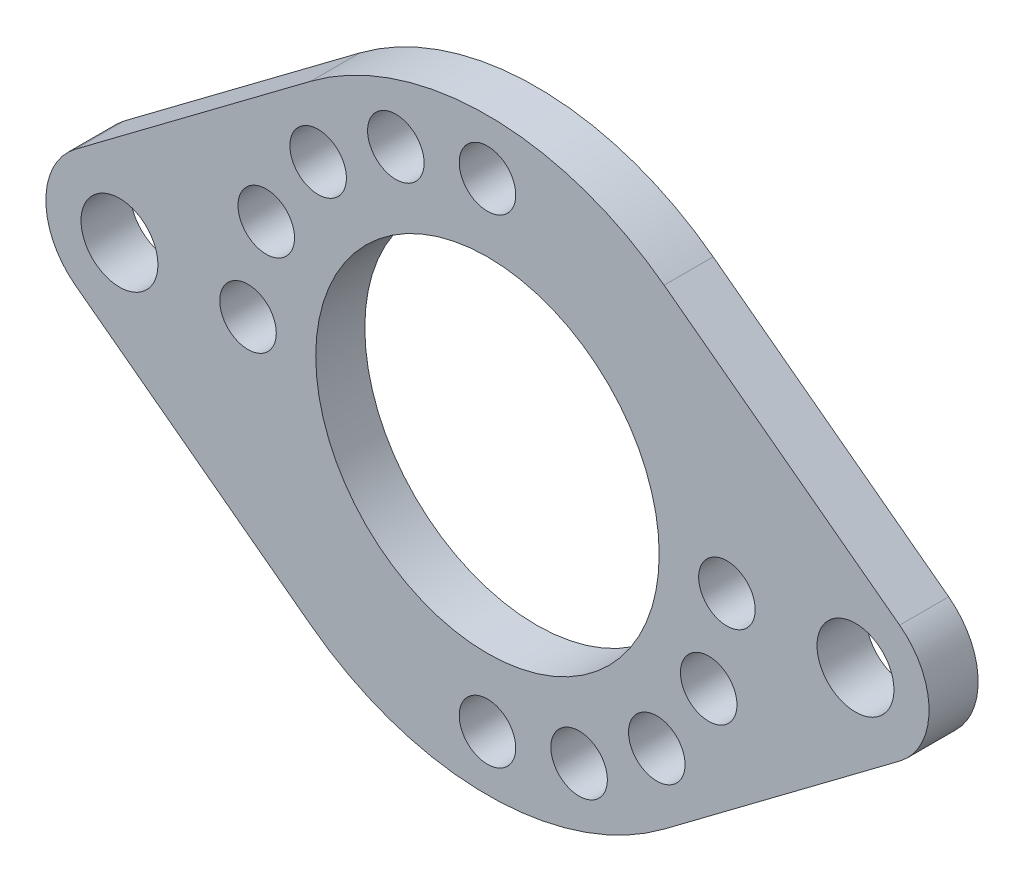
ISO-10303-21;
HEADER;
FILE_DESCRIPTION(('STEP AP214'),'2;1');
FILE_NAME('part.step','',(''),(''),'','','');
FILE_SCHEMA(('AUTOMOTIVE_DESIGN { 1 0 10303 214 1 1 1 1 }'));
ENDSEC;
DATA;
#1=APPLICATION_CONTEXT('core data for automotive mechanical design processes');
#2=APPLICATION_PROTOCOL_DEFINITION('international standard','automotive_design',2000,#1);
#3=PRODUCT_CONTEXT('',#1,'mechanical');
#4=PRODUCT('Part','Part','',(#3));
#5=PRODUCT_RELATED_PRODUCT_CATEGORY('part','',(#4));
#6=PRODUCT_DEFINITION_FORMATION('','',#4);
#7=PRODUCT_DEFINITION_CONTEXT('part definition',#1,'design');
#8=PRODUCT_DEFINITION('design','',#6,#7);
#9=PRODUCT_DEFINITION_SHAPE('','',#8);
#10=(LENGTH_UNIT() NAMED_UNIT(*) SI_UNIT(.MILLI.,.METRE.));
#11=(NAMED_UNIT(*) PLANE_ANGLE_UNIT() SI_UNIT($,.RADIAN.));
#12=(NAMED_UNIT(*) SI_UNIT($,.STERADIAN.) SOLID_ANGLE_UNIT());
#13=UNCERTAINTY_MEASURE_WITH_UNIT(LENGTH_MEASURE(1.E-05),#10,'distance_accuracy_value','');
#14=(GEOMETRIC_REPRESENTATION_CONTEXT(3) GLOBAL_UNCERTAINTY_ASSIGNED_CONTEXT((#13)) GLOBAL_UNIT_ASSIGNED_CONTEXT((#10,
#11,#12)) REPRESENTATION_CONTEXT('',''));
#15=CARTESIAN_POINT('',(0.,0.,0.));
#16=DIRECTION('',(0.,0.,1.));
#17=DIRECTION('',(1.,0.,0.));
#18=AXIS2_PLACEMENT_3D('',#15,#16,#17);
#19=CARTESIAN_POINT('',(0.,0.,-1.5875));
#20=DIRECTION('',(0.,0.,1.));
#21=DIRECTION('',(1.,0.,0.));
#22=AXIS2_PLACEMENT_3D('',#19,#20,#21);
#23=PLANE('',#22);
#24=CARTESIAN_POINT('',(0.,0.,-1.5875));
#25=DIRECTION('',(0.,0.,-1.));
#26=DIRECTION('',(-1.,0.,0.));
#27=AXIS2_PLACEMENT_3D('',#24,#25,#26);
#28=CIRCLE('',#27,11.1125);
#29=CARTESIAN_POINT('',(-11.1125,0.,-1.5875));
#30=VERTEX_POINT('',#29);
#31=EDGE_CURVE('E167',#30,#30,#28,.F.);
#32=ORIENTED_EDGE('',*,*,#31,.T.);
#33=EDGE_LOOP('',(#32));
#34=FACE_BOUND('',#33,.T.);
#35=CARTESIAN_POINT('',(-23.8125,0.,-1.5875));
#36=DIRECTION('',(0.,0.,-1.));
#37=DIRECTION('',(-1.,0.,0.));
#38=AXIS2_PLACEMENT_3D('',#35,#36,#37);
#39=CIRCLE('',#38,4.7625);
#40=CARTESIAN_POINT('',(-26.67,3.81,-1.5875));
#41=VERTEX_POINT('',#40);
#42=CARTESIAN_POINT('',(-26.67,-3.81,-1.5875));
#43=VERTEX_POINT('',#42);
#44=EDGE_CURVE('E171',#41,#43,#39,.F.);
#45=ORIENTED_EDGE('',*,*,#44,.F.);
#46=DIRECTION('',(-0.8,-0.6,0.));
#47=VECTOR('',#46,1.);
#48=CARTESIAN_POINT('',(-11.43,15.24,-1.5875));
#49=LINE('',#48,#47);
#50=CARTESIAN_POINT('',(-11.43,15.24,-1.5875));
#51=VERTEX_POINT('',#50);
#52=EDGE_CURVE('E110',#51,#41,#49,.T.);
#53=ORIENTED_EDGE('',*,*,#52,.F.);
#54=CARTESIAN_POINT('',(0.,0.,-1.5875));
#55=DIRECTION('',(0.,0.,-1.));
#56=DIRECTION('',(-1.,0.,0.));
#57=AXIS2_PLACEMENT_3D('',#54,#55,#56);
#58=CIRCLE('',#57,19.05);
#59=CARTESIAN_POINT('',(11.43,15.24,-1.5875));
#60=VERTEX_POINT('',#59);
#61=EDGE_CURVE('E115',#60,#51,#58,.F.);
#62=ORIENTED_EDGE('',*,*,#61,.F.);
#63=DIRECTION('',(0.8,-0.6,0.));
#64=VECTOR('',#63,1.);
#65=CARTESIAN_POINT('',(11.43,15.24,-1.5875));
#66=LINE('',#65,#64);
#67=CARTESIAN_POINT('',(26.67,3.81,-1.5875));
#68=VERTEX_POINT('',#67);
#69=EDGE_CURVE('E114',#60,#68,#66,.T.);
#70=ORIENTED_EDGE('',*,*,#69,.T.);
#71=CARTESIAN_POINT('',(23.8125,0.,-1.5875));
#72=DIRECTION('',(0.,0.,-1.));
#73=DIRECTION('',(-1.,0.,0.));
#74=AXIS2_PLACEMENT_3D('',#71,#72,#73);
#75=CIRCLE('',#74,4.7625);
#76=CARTESIAN_POINT('',(26.67,-3.81,-1.5875));
#77=VERTEX_POINT('',#76);
#78=EDGE_CURVE('E94',#77,#68,#75,.F.);
#79=ORIENTED_EDGE('',*,*,#78,.F.);
#80=DIRECTION('',(-0.8,-0.6,0.));
#81=VECTOR('',#80,1.);
#82=CARTESIAN_POINT('',(11.43,-15.24,-1.5875));
#83=LINE('',#82,#81);
#84=CARTESIAN_POINT('',(11.43,-15.24,-1.5875));
#85=VERTEX_POINT('',#84);
#86=EDGE_CURVE('E91',#77,#85,#83,.T.);
#87=ORIENTED_EDGE('',*,*,#86,.T.);
#88=CARTESIAN_POINT('',(0.,0.,-1.5875));
#89=DIRECTION('',(0.,0.,-1.));
#90=DIRECTION('',(-1.,0.,0.));
#91=AXIS2_PLACEMENT_3D('',#88,#89,#90);
#92=CIRCLE('',#91,19.05);
#93=CARTESIAN_POINT('',(-11.43,-15.24,-1.5875));
#94=VERTEX_POINT('',#93);
#95=EDGE_CURVE('E78',#94,#85,#92,.F.);
#96=ORIENTED_EDGE('',*,*,#95,.F.);
#97=DIRECTION('',(-0.8,0.6,0.));
#98=VECTOR('',#97,1.);
#99=CARTESIAN_POINT('',(-11.43,-15.24,-1.5875));
#100=LINE('',#99,#98);
#101=EDGE_CURVE('E88',#94,#43,#100,.T.);
#102=ORIENTED_EDGE('',*,*,#101,.T.);
#103=EDGE_LOOP('',(#45,#53,#62,#70,#79,#87,#96,#102));
#104=FACE_BOUND('',#103,.T.);
#105=CARTESIAN_POINT('',(0.,15.494,-1.5875));
#106=DIRECTION('',(0.,0.,1.));
#107=DIRECTION('',(1.,0.,0.));
#108=AXIS2_PLACEMENT_3D('',#105,#106,#107);
#109=CIRCLE('',#108,1.82879999999999);
#110=CARTESIAN_POINT('',(1.82879999999999,15.494,-1.5875));
#111=VERTEX_POINT('',#110);
#112=EDGE_CURVE('E109',#111,#111,#109,.T.);
#113=ORIENTED_EDGE('',*,*,#112,.T.);
#114=EDGE_LOOP('',(#113));
#115=FACE_BOUND('',#114,.T.);
#116=CARTESIAN_POINT('',(-15.494,0.,-1.5875));
#117=DIRECTION('',(0.,0.,1.));
#118=DIRECTION('',(1.,0.,0.));
#119=AXIS2_PLACEMENT_3D('',#116,#117,#118);
#120=CIRCLE('',#119,1.82879999999999);
#121=CARTESIAN_POINT('',(-13.6652,0.,-1.5875));
#122=VERTEX_POINT('',#121);
#123=EDGE_CURVE('E179',#122,#122,#120,.T.);
#124=ORIENTED_EDGE('',*,*,#123,.T.);
#125=EDGE_LOOP('',(#124));
#126=FACE_BOUND('',#125,.T.);
#127=CARTESIAN_POINT('',(-14.3145894767299,5.92929710106476,-1.5875));
#128=DIRECTION('',(0.,0.,1.));
#129=DIRECTION('',(1.,0.,0.));
#130=AXIS2_PLACEMENT_3D('',#127,#128,#129);
#131=CIRCLE('',#130,1.82879999999999);
#132=CARTESIAN_POINT('',(-12.4857894767299,5.92929710106476,-1.5875));
#133=VERTEX_POINT('',#132);
#134=EDGE_CURVE('E182',#133,#133,#131,.T.);
#135=ORIENTED_EDGE('',*,*,#134,.T.);
#136=EDGE_LOOP('',(#135));
#137=FACE_BOUND('',#136,.T.);
#138=CARTESIAN_POINT('',(-5.92929710106471,14.3145894767299,-1.5875));
#139=DIRECTION('',(0.,0.,1.));
#140=DIRECTION('',(1.,0.,0.));
#141=AXIS2_PLACEMENT_3D('',#138,#139,#140);
#142=CIRCLE('',#141,1.82879999999999);
#143=CARTESIAN_POINT('',(-4.10049710106472,14.3145894767299,-1.5875));
#144=VERTEX_POINT('',#143);
#145=EDGE_CURVE('E185',#144,#144,#142,.T.);
#146=ORIENTED_EDGE('',*,*,#145,.T.);
#147=EDGE_LOOP('',(#146));
#148=FACE_BOUND('',#147,.T.);
#149=CARTESIAN_POINT('',(-10.9559124677044,10.9559124677043,-1.5875));
#150=DIRECTION('',(0.,0.,1.));
#151=DIRECTION('',(1.,0.,0.));
#152=AXIS2_PLACEMENT_3D('',#149,#150,#151);
#153=CIRCLE('',#152,1.82879999999999);
#154=CARTESIAN_POINT('',(-9.1271124677044,10.9559124677043,-1.5875));
#155=VERTEX_POINT('',#154);
#156=EDGE_CURVE('E188',#155,#155,#153,.T.);
#157=ORIENTED_EDGE('',*,*,#156,.T.);
#158=EDGE_LOOP('',(#157));
#159=FACE_BOUND('',#158,.T.);
#160=CARTESIAN_POINT('',(0.,-15.494,-1.5875));
#161=DIRECTION('',(0.,0.,1.));
#162=DIRECTION('',(1.,0.,0.));
#163=AXIS2_PLACEMENT_3D('',#160,#161,#162);
#164=CIRCLE('',#163,1.82879999999999);
#165=CARTESIAN_POINT('',(1.82879999999999,-15.494,-1.5875));
#166=VERTEX_POINT('',#165);
#167=EDGE_CURVE('E191',#166,#166,#164,.T.);
#168=ORIENTED_EDGE('',*,*,#167,.T.);
#169=EDGE_LOOP('',(#168));
#170=FACE_BOUND('',#169,.T.);
#171=CARTESIAN_POINT('',(15.494,0.,-1.5875));
#172=DIRECTION('',(0.,0.,1.));
#173=DIRECTION('',(1.,0.,0.));
#174=AXIS2_PLACEMENT_3D('',#171,#172,#173);
#175=CIRCLE('',#174,1.82879999999999);
#176=CARTESIAN_POINT('',(17.3228,0.,-1.5875));
#177=VERTEX_POINT('',#176);
#178=EDGE_CURVE('E194',#177,#177,#175,.T.);
#179=ORIENTED_EDGE('',*,*,#178,.T.);
#180=EDGE_LOOP('',(#179));
#181=FACE_BOUND('',#180,.T.);
#182=CARTESIAN_POINT('',(14.3145894767299,-5.92929710106476,-1.5875));
#183=DIRECTION('',(0.,0.,1.));
#184=DIRECTION('',(1.,0.,0.));
#185=AXIS2_PLACEMENT_3D('',#182,#183,#184);
#186=CIRCLE('',#185,1.82879999999999);
#187=CARTESIAN_POINT('',(16.1433894767298,-5.92929710106476,-1.5875));
#188=VERTEX_POINT('',#187);
#189=EDGE_CURVE('E197',#188,#188,#186,.T.);
#190=ORIENTED_EDGE('',*,*,#189,.T.);
#191=EDGE_LOOP('',(#190));
#192=FACE_BOUND('',#191,.T.);
#193=CARTESIAN_POINT('',(5.92929710106471,-14.3145894767299,-1.5875));
#194=DIRECTION('',(0.,0.,1.));
#195=DIRECTION('',(1.,0.,0.));
#196=AXIS2_PLACEMENT_3D('',#193,#194,#195);
#197=CIRCLE('',#196,1.82879999999999);
#198=CARTESIAN_POINT('',(7.7580971010647,-14.3145894767299,-1.5875));
#199=VERTEX_POINT('',#198);
#200=EDGE_CURVE('E200',#199,#199,#197,.T.);
#201=ORIENTED_EDGE('',*,*,#200,.T.);
#202=EDGE_LOOP('',(#201));
#203=FACE_BOUND('',#202,.T.);
#204=CARTESIAN_POINT('',(10.9559124677044,-10.9559124677043,-1.5875));
#205=DIRECTION('',(0.,0.,1.));
#206=DIRECTION('',(1.,0.,0.));
#207=AXIS2_PLACEMENT_3D('',#204,#205,#206);
#208=CIRCLE('',#207,1.82879999999999);
#209=CARTESIAN_POINT('',(12.7847124677044,-10.9559124677043,-1.5875));
#210=VERTEX_POINT('',#209);
#211=EDGE_CURVE('E203',#210,#210,#208,.T.);
#212=ORIENTED_EDGE('',*,*,#211,.T.);
#213=EDGE_LOOP('',(#212));
#214=FACE_BOUND('',#213,.T.);
#215=CARTESIAN_POINT('',(-23.8125,0.,-1.5875));
#216=DIRECTION('',(0.,0.,1.));
#217=DIRECTION('',(1.,0.,0.));
#218=AXIS2_PLACEMENT_3D('',#215,#216,#217);
#219=CIRCLE('',#218,2.48919999999999);
#220=CARTESIAN_POINT('',(-21.3233,0.,-1.5875));
#221=VERTEX_POINT('',#220);
#222=EDGE_CURVE('E205',#221,#221,#219,.T.);
#223=ORIENTED_EDGE('',*,*,#222,.T.);
#224=EDGE_LOOP('',(#223));
#225=FACE_BOUND('',#224,.T.);
#226=CARTESIAN_POINT('',(23.8125,0.,-1.5875));
#227=DIRECTION('',(0.,0.,1.));
#228=DIRECTION('',(1.,0.,0.));
#229=AXIS2_PLACEMENT_3D('',#226,#227,#228);
#230=CIRCLE('',#229,2.48919999999999);
#231=CARTESIAN_POINT('',(26.3017,0.,-1.5875));
#232=VERTEX_POINT('',#231);
#233=EDGE_CURVE('E19',#232,#232,#230,.T.);
#234=ORIENTED_EDGE('',*,*,#233,.T.);
#235=EDGE_LOOP('',(#234));
#236=FACE_BOUND('',#235,.T.);
#237=ADVANCED_FACE('F16',(#34,#104,#115,#126,#137,#148,#159,#170,#181,#192,#203,#214,#225,#236),
#23,.F.);
#238=CARTESIAN_POINT('',(23.8125,0.,1.5875));
#239=DIRECTION('',(0.,0.,1.));
#240=DIRECTION('',(1.,0.,0.));
#241=AXIS2_PLACEMENT_3D('',#238,#239,#240);
#242=CYLINDRICAL_SURFACE('',#241,2.48919999999999);
#243=CARTESIAN_POINT('',(23.8125,0.,1.5875));
#244=DIRECTION('',(0.,0.,1.));
#245=DIRECTION('',(1.,0.,0.));
#246=AXIS2_PLACEMENT_3D('',#243,#244,#245);
#247=CIRCLE('',#246,2.48919999999999);
#248=CARTESIAN_POINT('',(26.3017,0.,1.5875));
#249=VERTEX_POINT('',#248);
#250=EDGE_CURVE('E164',#249,#249,#247,.F.);
#251=ORIENTED_EDGE('',*,*,#250,.F.);
#252=EDGE_LOOP('',(#251));
#253=FACE_BOUND('',#252,.T.);
#254=ORIENTED_EDGE('',*,*,#233,.F.);
#255=EDGE_LOOP('',(#254));
#256=FACE_BOUND('',#255,.T.);
#257=ADVANCED_FACE('F213',(#253,#256),#242,.F.);
#258=CARTESIAN_POINT('',(-23.8125,0.,1.5875));
#259=DIRECTION('',(0.,0.,1.));
#260=DIRECTION('',(1.,0.,0.));
#261=AXIS2_PLACEMENT_3D('',#258,#259,#260);
#262=CYLINDRICAL_SURFACE('',#261,2.48919999999999);
#263=CARTESIAN_POINT('',(-23.8125,0.,1.5875));
#264=DIRECTION('',(0.,0.,1.));
#265=DIRECTION('',(1.,0.,0.));
#266=AXIS2_PLACEMENT_3D('',#263,#264,#265);
#267=CIRCLE('',#266,2.48919999999999);
#268=CARTESIAN_POINT('',(-21.3233,0.,1.5875));
#269=VERTEX_POINT('',#268);
#270=EDGE_CURVE('E161',#269,#269,#267,.F.);
#271=ORIENTED_EDGE('',*,*,#270,.F.);
#272=EDGE_LOOP('',(#271));
#273=FACE_BOUND('',#272,.T.);
#274=ORIENTED_EDGE('',*,*,#222,.F.);
#275=EDGE_LOOP('',(#274));
#276=FACE_BOUND('',#275,.T.);
#277=ADVANCED_FACE('F215',(#273,#276),#262,.F.);
#278=CARTESIAN_POINT('',(10.9559124677044,-10.9559124677043,1.5875));
#279=DIRECTION('',(0.,0.,1.));
#280=DIRECTION('',(1.,0.,0.));
#281=AXIS2_PLACEMENT_3D('',#278,#279,#280);
#282=CYLINDRICAL_SURFACE('',#281,1.82879999999999);
#283=CARTESIAN_POINT('',(10.9559124677044,-10.9559124677043,1.5875));
#284=DIRECTION('',(0.,0.,1.));
#285=DIRECTION('',(1.,0.,0.));
#286=AXIS2_PLACEMENT_3D('',#283,#284,#285);
#287=CIRCLE('',#286,1.82879999999999);
#288=CARTESIAN_POINT('',(12.7847124677044,-10.9559124677043,1.5875));
#289=VERTEX_POINT('',#288);
#290=EDGE_CURVE('E158',#289,#289,#287,.F.);
#291=ORIENTED_EDGE('',*,*,#290,.F.);
#292=EDGE_LOOP('',(#291));
#293=FACE_BOUND('',#292,.T.);
#294=ORIENTED_EDGE('',*,*,#211,.F.);
#295=EDGE_LOOP('',(#294));
#296=FACE_BOUND('',#295,.T.);
#297=ADVANCED_FACE('F222',(#293,#296),#282,.F.);
#298=CARTESIAN_POINT('',(5.92929710106471,-14.3145894767299,1.5875));
#299=DIRECTION('',(0.,0.,1.));
#300=DIRECTION('',(1.,0.,0.));
#301=AXIS2_PLACEMENT_3D('',#298,#299,#300);
#302=CYLINDRICAL_SURFACE('',#301,1.82879999999999);
#303=CARTESIAN_POINT('',(5.92929710106471,-14.3145894767299,1.5875));
#304=DIRECTION('',(0.,0.,1.));
#305=DIRECTION('',(1.,0.,0.));
#306=AXIS2_PLACEMENT_3D('',#303,#304,#305);
#307=CIRCLE('',#306,1.82879999999999);
#308=CARTESIAN_POINT('',(7.7580971010647,-14.3145894767299,1.5875));
#309=VERTEX_POINT('',#308);
#310=EDGE_CURVE('E155',#309,#309,#307,.F.);
#311=ORIENTED_EDGE('',*,*,#310,.F.);
#312=EDGE_LOOP('',(#311));
#313=FACE_BOUND('',#312,.T.);
#314=ORIENTED_EDGE('',*,*,#200,.F.);
#315=EDGE_LOOP('',(#314));
#316=FACE_BOUND('',#315,.T.);
#317=ADVANCED_FACE('F298',(#313,#316),#302,.F.);
#318=CARTESIAN_POINT('',(14.3145894767299,-5.92929710106476,1.5875));
#319=DIRECTION('',(0.,0.,1.));
#320=DIRECTION('',(1.,0.,0.));
#321=AXIS2_PLACEMENT_3D('',#318,#319,#320);
#322=CYLINDRICAL_SURFACE('',#321,1.82879999999999);
#323=CARTESIAN_POINT('',(14.3145894767299,-5.92929710106476,1.5875));
#324=DIRECTION('',(0.,0.,1.));
#325=DIRECTION('',(1.,0.,0.));
#326=AXIS2_PLACEMENT_3D('',#323,#324,#325);
#327=CIRCLE('',#326,1.82879999999999);
#328=CARTESIAN_POINT('',(16.1433894767298,-5.92929710106476,1.5875));
#329=VERTEX_POINT('',#328);
#330=EDGE_CURVE('E152',#329,#329,#327,.F.);
#331=ORIENTED_EDGE('',*,*,#330,.F.);
#332=EDGE_LOOP('',(#331));
#333=FACE_BOUND('',#332,.T.);
#334=ORIENTED_EDGE('',*,*,#189,.F.);
#335=EDGE_LOOP('',(#334));
#336=FACE_BOUND('',#335,.T.);
#337=ADVANCED_FACE('F294',(#333,#336),#322,.F.);
#338=CARTESIAN_POINT('',(15.494,0.,1.5875));
#339=DIRECTION('',(0.,0.,1.));
#340=DIRECTION('',(1.,0.,0.));
#341=AXIS2_PLACEMENT_3D('',#338,#339,#340);
#342=CYLINDRICAL_SURFACE('',#341,1.82879999999999);
#343=CARTESIAN_POINT('',(15.494,0.,1.5875));
#344=DIRECTION('',(0.,0.,1.));
#345=DIRECTION('',(1.,0.,0.));
#346=AXIS2_PLACEMENT_3D('',#343,#344,#345);
#347=CIRCLE('',#346,1.82879999999999);
#348=CARTESIAN_POINT('',(17.3228,0.,1.5875));
#349=VERTEX_POINT('',#348);
#350=EDGE_CURVE('E149',#349,#349,#347,.F.);
#351=ORIENTED_EDGE('',*,*,#350,.F.);
#352=EDGE_LOOP('',(#351));
#353=FACE_BOUND('',#352,.T.);
#354=ORIENTED_EDGE('',*,*,#178,.F.);
#355=EDGE_LOOP('',(#354));
#356=FACE_BOUND('',#355,.T.);
#357=ADVANCED_FACE('F290',(#353,#356),#342,.F.);
#358=CARTESIAN_POINT('',(0.,-15.494,1.5875));
#359=DIRECTION('',(0.,0.,1.));
#360=DIRECTION('',(1.,0.,0.));
#361=AXIS2_PLACEMENT_3D('',#358,#359,#360);
#362=CYLINDRICAL_SURFACE('',#361,1.82879999999999);
#363=CARTESIAN_POINT('',(0.,-15.494,1.5875));
#364=DIRECTION('',(0.,0.,1.));
#365=DIRECTION('',(1.,0.,0.));
#366=AXIS2_PLACEMENT_3D('',#363,#364,#365);
#367=CIRCLE('',#366,1.82879999999999);
#368=CARTESIAN_POINT('',(1.82879999999999,-15.494,1.5875));
#369=VERTEX_POINT('',#368);
#370=EDGE_CURVE('E146',#369,#369,#367,.F.);
#371=ORIENTED_EDGE('',*,*,#370,.F.);
#372=EDGE_LOOP('',(#371));
#373=FACE_BOUND('',#372,.T.);
#374=ORIENTED_EDGE('',*,*,#167,.F.);
#375=EDGE_LOOP('',(#374));
#376=FACE_BOUND('',#375,.T.);
#377=ADVANCED_FACE('F286',(#373,#376),#362,.F.);
#378=CARTESIAN_POINT('',(-10.9559124677044,10.9559124677043,1.5875));
#379=DIRECTION('',(0.,0.,1.));
#380=DIRECTION('',(1.,0.,0.));
#381=AXIS2_PLACEMENT_3D('',#378,#379,#380);
#382=CYLINDRICAL_SURFACE('',#381,1.82879999999999);
#383=CARTESIAN_POINT('',(-10.9559124677044,10.9559124677043,1.5875));
#384=DIRECTION('',(0.,0.,1.));
#385=DIRECTION('',(1.,0.,0.));
#386=AXIS2_PLACEMENT_3D('',#383,#384,#385);
#387=CIRCLE('',#386,1.82879999999999);
#388=CARTESIAN_POINT('',(-9.1271124677044,10.9559124677043,1.5875));
#389=VERTEX_POINT('',#388);
#390=EDGE_CURVE('E143',#389,#389,#387,.F.);
#391=ORIENTED_EDGE('',*,*,#390,.F.);
#392=EDGE_LOOP('',(#391));
#393=FACE_BOUND('',#392,.T.);
#394=ORIENTED_EDGE('',*,*,#156,.F.);
#395=EDGE_LOOP('',(#394));
#396=FACE_BOUND('',#395,.T.);
#397=ADVANCED_FACE('F282',(#393,#396),#382,.F.);
#398=CARTESIAN_POINT('',(-5.92929710106471,14.3145894767299,1.5875));
#399=DIRECTION('',(0.,0.,1.));
#400=DIRECTION('',(1.,0.,0.));
#401=AXIS2_PLACEMENT_3D('',#398,#399,#400);
#402=CYLINDRICAL_SURFACE('',#401,1.82879999999999);
#403=CARTESIAN_POINT('',(-5.92929710106471,14.3145894767299,1.5875));
#404=DIRECTION('',(0.,0.,1.));
#405=DIRECTION('',(1.,0.,0.));
#406=AXIS2_PLACEMENT_3D('',#403,#404,#405);
#407=CIRCLE('',#406,1.82879999999999);
#408=CARTESIAN_POINT('',(-4.10049710106472,14.3145894767299,1.5875));
#409=VERTEX_POINT('',#408);
#410=EDGE_CURVE('E140',#409,#409,#407,.F.);
#411=ORIENTED_EDGE('',*,*,#410,.F.);
#412=EDGE_LOOP('',(#411));
#413=FACE_BOUND('',#412,.T.);
#414=ORIENTED_EDGE('',*,*,#145,.F.);
#415=EDGE_LOOP('',(#414));
#416=FACE_BOUND('',#415,.T.);
#417=ADVANCED_FACE('F278',(#413,#416),#402,.F.);
#418=CARTESIAN_POINT('',(-14.3145894767299,5.92929710106476,1.5875));
#419=DIRECTION('',(0.,0.,1.));
#420=DIRECTION('',(1.,0.,0.));
#421=AXIS2_PLACEMENT_3D('',#418,#419,#420);
#422=CYLINDRICAL_SURFACE('',#421,1.82879999999999);
#423=CARTESIAN_POINT('',(-14.3145894767299,5.92929710106476,1.5875));
#424=DIRECTION('',(0.,0.,1.));
#425=DIRECTION('',(1.,0.,0.));
#426=AXIS2_PLACEMENT_3D('',#423,#424,#425);
#427=CIRCLE('',#426,1.82879999999999);
#428=CARTESIAN_POINT('',(-12.4857894767299,5.92929710106476,1.5875));
#429=VERTEX_POINT('',#428);
#430=EDGE_CURVE('E137',#429,#429,#427,.F.);
#431=ORIENTED_EDGE('',*,*,#430,.F.);
#432=EDGE_LOOP('',(#431));
#433=FACE_BOUND('',#432,.T.);
#434=ORIENTED_EDGE('',*,*,#134,.F.);
#435=EDGE_LOOP('',(#434));
#436=FACE_BOUND('',#435,.T.);
#437=ADVANCED_FACE('F274',(#433,#436),#422,.F.);
#438=CARTESIAN_POINT('',(-15.494,0.,1.5875));
#439=DIRECTION('',(0.,0.,1.));
#440=DIRECTION('',(1.,0.,0.));
#441=AXIS2_PLACEMENT_3D('',#438,#439,#440);
#442=CYLINDRICAL_SURFACE('',#441,1.82879999999999);
#443=CARTESIAN_POINT('',(-15.494,0.,1.5875));
#444=DIRECTION('',(0.,0.,1.));
#445=DIRECTION('',(1.,0.,0.));
#446=AXIS2_PLACEMENT_3D('',#443,#444,#445);
#447=CIRCLE('',#446,1.82879999999999);
#448=CARTESIAN_POINT('',(-13.6652,0.,1.5875));
#449=VERTEX_POINT('',#448);
#450=EDGE_CURVE('E134',#449,#449,#447,.F.);
#451=ORIENTED_EDGE('',*,*,#450,.F.);
#452=EDGE_LOOP('',(#451));
#453=FACE_BOUND('',#452,.T.);
#454=ORIENTED_EDGE('',*,*,#123,.F.);
#455=EDGE_LOOP('',(#454));
#456=FACE_BOUND('',#455,.T.);
#457=ADVANCED_FACE('F270',(#453,#456),#442,.F.);
#458=CARTESIAN_POINT('',(0.,15.494,1.5875));
#459=DIRECTION('',(0.,0.,1.));
#460=DIRECTION('',(1.,0.,0.));
#461=AXIS2_PLACEMENT_3D('',#458,#459,#460);
#462=CYLINDRICAL_SURFACE('',#461,1.82879999999999);
#463=CARTESIAN_POINT('',(0.,15.494,1.5875));
#464=DIRECTION('',(0.,0.,1.));
#465=DIRECTION('',(1.,0.,0.));
#466=AXIS2_PLACEMENT_3D('',#463,#464,#465);
#467=CIRCLE('',#466,1.82879999999999);
#468=CARTESIAN_POINT('',(1.82879999999999,15.494,1.5875));
#469=VERTEX_POINT('',#468);
#470=EDGE_CURVE('E131',#469,#469,#467,.F.);
#471=ORIENTED_EDGE('',*,*,#470,.F.);
#472=EDGE_LOOP('',(#471));
#473=FACE_BOUND('',#472,.T.);
#474=ORIENTED_EDGE('',*,*,#112,.F.);
#475=EDGE_LOOP('',(#474));
#476=FACE_BOUND('',#475,.T.);
#477=ADVANCED_FACE('F266',(#473,#476),#462,.F.);
#478=CARTESIAN_POINT('',(-11.43,-15.24,1.5875));
#479=DIRECTION('',(0.6,0.8,0.));
#480=DIRECTION('',(-0.8,0.6,0.));
#481=AXIS2_PLACEMENT_3D('',#478,#479,#480);
#482=PLANE('',#481);
#483=DIRECTION('',(0.,0.,-1.));
#484=VECTOR('',#483,1.);
#485=CARTESIAN_POINT('',(-11.43,-15.24,1.5875));
#486=LINE('',#485,#484);
#487=CARTESIAN_POINT('',(-11.43,-15.24,1.5875));
#488=VERTEX_POINT('',#487);
#489=EDGE_CURVE('E87',#488,#94,#486,.T.);
#490=ORIENTED_EDGE('',*,*,#489,.F.);
#491=DIRECTION('',(0.8,-0.6,0.));
#492=VECTOR('',#491,1.);
#493=CARTESIAN_POINT('',(-26.67,-3.81,1.5875));
#494=LINE('',#493,#492);
#495=CARTESIAN_POINT('',(-26.67,-3.81,1.5875));
#496=VERTEX_POINT('',#495);
#497=EDGE_CURVE('E130',#496,#488,#494,.T.);
#498=ORIENTED_EDGE('',*,*,#497,.F.);
#499=DIRECTION('',(0.,0.,-1.));
#500=VECTOR('',#499,1.);
#501=CARTESIAN_POINT('',(-26.67,-3.81,1.5875));
#502=LINE('',#501,#500);
#503=EDGE_CURVE('E170',#43,#496,#502,.F.);
#504=ORIENTED_EDGE('',*,*,#503,.F.);
#505=ORIENTED_EDGE('',*,*,#101,.F.);
#506=EDGE_LOOP('',(#490,#498,#504,#505));
#507=FACE_BOUND('',#506,.T.);
#508=ADVANCED_FACE('F263',(#507),#482,.F.);
#509=CARTESIAN_POINT('',(0.,0.,1.5875));
#510=DIRECTION('',(0.,0.,-1.));
#511=DIRECTION('',(-1.,0.,0.));
#512=AXIS2_PLACEMENT_3D('',#509,#510,#511);
#513=CYLINDRICAL_SURFACE('',#512,19.05);
#514=CARTESIAN_POINT('',(0.,0.,1.5875));
#515=DIRECTION('',(0.,0.,-1.));
#516=DIRECTION('',(-1.,0.,0.));
#517=AXIS2_PLACEMENT_3D('',#514,#515,#516);
#518=CIRCLE('',#517,19.05);
#519=CARTESIAN_POINT('',(11.43,-15.24,1.5875));
#520=VERTEX_POINT('',#519);
#521=EDGE_CURVE('E128',#488,#520,#518,.F.);
#522=ORIENTED_EDGE('',*,*,#521,.F.);
#523=ORIENTED_EDGE('',*,*,#489,.T.);
#524=ORIENTED_EDGE('',*,*,#95,.T.);
#525=DIRECTION('',(0.,0.,1.));
#526=VECTOR('',#525,1.);
#527=CARTESIAN_POINT('',(11.43,-15.24,1.5875));
#528=LINE('',#527,#526);
#529=EDGE_CURVE('E85',#85,#520,#528,.T.);
#530=ORIENTED_EDGE('',*,*,#529,.T.);
#531=EDGE_LOOP('',(#522,#523,#524,#530));
#532=FACE_BOUND('',#531,.T.);
#533=ADVANCED_FACE('F83',(#532),#513,.T.);
#534=CARTESIAN_POINT('',(11.43,-15.24,1.5875));
#535=DIRECTION('',(-0.6,0.8,0.));
#536=DIRECTION('',(-0.8,-0.6,0.));
#537=AXIS2_PLACEMENT_3D('',#534,#535,#536);
#538=PLANE('',#537);
#539=DIRECTION('',(0.,0.,-1.));
#540=VECTOR('',#539,1.);
#541=CARTESIAN_POINT('',(26.67,-3.81,1.5875));
#542=LINE('',#541,#540);
#543=CARTESIAN_POINT('',(26.67,-3.81,1.5875));
#544=VERTEX_POINT('',#543);
#545=EDGE_CURVE('E105',#544,#77,#542,.T.);
#546=ORIENTED_EDGE('',*,*,#545,.F.);
#547=DIRECTION('',(0.8,0.6,0.));
#548=VECTOR('',#547,1.);
#549=CARTESIAN_POINT('',(11.43,-15.24,1.5875));
#550=LINE('',#549,#548);
#551=EDGE_CURVE('E100',#520,#544,#550,.T.);
#552=ORIENTED_EDGE('',*,*,#551,.F.);
#553=ORIENTED_EDGE('',*,*,#529,.F.);
#554=ORIENTED_EDGE('',*,*,#86,.F.);
#555=EDGE_LOOP('',(#546,#552,#553,#554));
#556=FACE_BOUND('',#555,.T.);
#557=ADVANCED_FACE('F98',(#556),#538,.F.);
#558=CARTESIAN_POINT('',(23.8125,0.,1.5875));
#559=DIRECTION('',(0.,0.,-1.));
#560=DIRECTION('',(-1.,0.,0.));
#561=AXIS2_PLACEMENT_3D('',#558,#559,#560);
#562=CYLINDRICAL_SURFACE('',#561,4.7625);
#563=CARTESIAN_POINT('',(23.8125,0.,1.5875));
#564=DIRECTION('',(0.,0.,-1.));
#565=DIRECTION('',(-1.,0.,0.));
#566=AXIS2_PLACEMENT_3D('',#563,#564,#565);
#567=CIRCLE('',#566,4.7625);
#568=CARTESIAN_POINT('',(26.67,3.81,1.5875));
#569=VERTEX_POINT('',#568);
#570=EDGE_CURVE('E125',#544,#569,#567,.F.);
#571=ORIENTED_EDGE('',*,*,#570,.F.);
#572=ORIENTED_EDGE('',*,*,#545,.T.);
#573=ORIENTED_EDGE('',*,*,#78,.T.);
#574=DIRECTION('',(0.,0.,1.));
#575=VECTOR('',#574,1.);
#576=CARTESIAN_POINT('',(26.67,3.81,1.5875));
#577=LINE('',#576,#575);
#578=EDGE_CURVE('E116',#68,#569,#577,.T.);
#579=ORIENTED_EDGE('',*,*,#578,.T.);
#580=EDGE_LOOP('',(#571,#572,#573,#579));
#581=FACE_BOUND('',#580,.T.);
#582=ADVANCED_FACE('F254',(#581),#562,.T.);
#583=CARTESIAN_POINT('',(11.43,15.24,1.5875));
#584=DIRECTION('',(-0.6,-0.8,0.));
#585=DIRECTION('',(0.8,-0.6,0.));
#586=AXIS2_PLACEMENT_3D('',#583,#584,#585);
#587=PLANE('',#586);
#588=DIRECTION('',(0.,0.,-1.));
#589=VECTOR('',#588,1.);
#590=CARTESIAN_POINT('',(11.43,15.24,1.5875));
#591=LINE('',#590,#589);
#592=CARTESIAN_POINT('',(11.43,15.24,1.5875));
#593=VERTEX_POINT('',#592);
#594=EDGE_CURVE('E113',#593,#60,#591,.T.);
#595=ORIENTED_EDGE('',*,*,#594,.F.);
#596=DIRECTION('',(-0.8,0.6,0.));
#597=VECTOR('',#596,1.);
#598=CARTESIAN_POINT('',(26.67,3.81,1.5875));
#599=LINE('',#598,#597);
#600=EDGE_CURVE('E124',#569,#593,#599,.T.);
#601=ORIENTED_EDGE('',*,*,#600,.F.);
#602=ORIENTED_EDGE('',*,*,#578,.F.);
#603=ORIENTED_EDGE('',*,*,#69,.F.);
#604=EDGE_LOOP('',(#595,#601,#602,#603));
#605=FACE_BOUND('',#604,.T.);
#606=ADVANCED_FACE('F250',(#605),#587,.F.);
#607=CARTESIAN_POINT('',(0.,0.,1.5875));
#608=DIRECTION('',(0.,0.,-1.));
#609=DIRECTION('',(-1.,0.,0.));
#610=AXIS2_PLACEMENT_3D('',#607,#608,#609);
#611=CYLINDRICAL_SURFACE('',#610,19.05);
#612=CARTESIAN_POINT('',(0.,0.,1.5875));
#613=DIRECTION('',(0.,0.,-1.));
#614=DIRECTION('',(-1.,0.,0.));
#615=AXIS2_PLACEMENT_3D('',#612,#613,#614);
#616=CIRCLE('',#615,19.05);
#617=CARTESIAN_POINT('',(-11.43,15.24,1.5875));
#618=VERTEX_POINT('',#617);
#619=EDGE_CURVE('E121',#593,#618,#616,.F.);
#620=ORIENTED_EDGE('',*,*,#619,.F.);
#621=ORIENTED_EDGE('',*,*,#594,.T.);
#622=ORIENTED_EDGE('',*,*,#61,.T.);
#623=DIRECTION('',(0.,0.,1.));
#624=VECTOR('',#623,1.);
#625=CARTESIAN_POINT('',(-11.43,15.24,1.5875));
#626=LINE('',#625,#624);
#627=EDGE_CURVE('E112',#618,#51,#626,.F.);
#628=ORIENTED_EDGE('',*,*,#627,.F.);
#629=EDGE_LOOP('',(#620,#621,#622,#628));
#630=FACE_BOUND('',#629,.T.);
#631=ADVANCED_FACE('F247',(#630),#611,.T.);
#632=CARTESIAN_POINT('',(-11.43,15.24,1.5875));
#633=DIRECTION('',(-0.6,0.8,0.));
#634=DIRECTION('',(-0.8,-0.6,0.));
#635=AXIS2_PLACEMENT_3D('',#632,#633,#634);
#636=PLANE('',#635);
#637=DIRECTION('',(-0.8,-0.6,0.));
#638=VECTOR('',#637,1.);
#639=CARTESIAN_POINT('',(-11.43,15.24,1.5875));
#640=LINE('',#639,#638);
#641=CARTESIAN_POINT('',(-26.67,3.81,1.5875));
#642=VERTEX_POINT('',#641);
#643=EDGE_CURVE('E120',#618,#642,#640,.T.);
#644=ORIENTED_EDGE('',*,*,#643,.F.);
#645=ORIENTED_EDGE('',*,*,#627,.T.);
#646=ORIENTED_EDGE('',*,*,#52,.T.);
#647=DIRECTION('',(0.,0.,-1.));
#648=VECTOR('',#647,1.);
#649=CARTESIAN_POINT('',(-26.67,3.81,1.5875));
#650=LINE('',#649,#648);
#651=EDGE_CURVE('E34',#642,#41,#650,.T.);
#652=ORIENTED_EDGE('',*,*,#651,.F.);
#653=EDGE_LOOP('',(#644,#645,#646,#652));
#654=FACE_BOUND('',#653,.T.);
#655=ADVANCED_FACE('F243',(#654),#636,.T.);
#656=CARTESIAN_POINT('',(-23.8125,0.,1.5875));
#657=DIRECTION('',(0.,0.,-1.));
#658=DIRECTION('',(-1.,0.,0.));
#659=AXIS2_PLACEMENT_3D('',#656,#657,#658);
#660=CYLINDRICAL_SURFACE('',#659,4.7625);
#661=ORIENTED_EDGE('',*,*,#44,.T.);
#662=ORIENTED_EDGE('',*,*,#503,.T.);
#663=CARTESIAN_POINT('',(-23.8125,0.,1.5875));
#664=DIRECTION('',(0.,0.,-1.));
#665=DIRECTION('',(-1.,0.,0.));
#666=AXIS2_PLACEMENT_3D('',#663,#664,#665);
#667=CIRCLE('',#666,4.7625);
#668=EDGE_CURVE('E25',#642,#496,#667,.F.);
#669=ORIENTED_EDGE('',*,*,#668,.F.);
#670=ORIENTED_EDGE('',*,*,#651,.T.);
#671=EDGE_LOOP('',(#661,#662,#669,#670));
#672=FACE_BOUND('',#671,.T.);
#673=ADVANCED_FACE('F236',(#672),#660,.T.);
#674=CARTESIAN_POINT('',(0.,0.,1.5875));
#675=DIRECTION('',(0.,0.,-1.));
#676=DIRECTION('',(-1.,0.,0.));
#677=AXIS2_PLACEMENT_3D('',#674,#675,#676);
#678=CYLINDRICAL_SURFACE('',#677,11.1125);
#679=CARTESIAN_POINT('',(0.,0.,1.5875));
#680=DIRECTION('',(0.,0.,-1.));
#681=DIRECTION('',(-1.,0.,0.));
#682=AXIS2_PLACEMENT_3D('',#679,#680,#681);
#683=CIRCLE('',#682,11.1125);
#684=CARTESIAN_POINT('',(-11.1125,0.,1.5875));
#685=VERTEX_POINT('',#684);
#686=EDGE_CURVE('E11',#685,#685,#683,.T.);
#687=ORIENTED_EDGE('',*,*,#686,.F.);
#688=EDGE_LOOP('',(#687));
#689=FACE_BOUND('',#688,.T.);
#690=ORIENTED_EDGE('',*,*,#31,.F.);
#691=EDGE_LOOP('',(#690));
#692=FACE_BOUND('',#691,.T.);
#693=ADVANCED_FACE('F230',(#689,#692),#678,.F.);
#694=CARTESIAN_POINT('',(0.,0.,1.5875));
#695=DIRECTION('',(0.,0.,1.));
#696=DIRECTION('',(1.,0.,0.));
#697=AXIS2_PLACEMENT_3D('',#694,#695,#696);
#698=PLANE('',#697);
#699=ORIENTED_EDGE('',*,*,#686,.T.);
#700=EDGE_LOOP('',(#699));
#701=FACE_BOUND('',#700,.T.);
#702=ORIENTED_EDGE('',*,*,#668,.T.);
#703=ORIENTED_EDGE('',*,*,#497,.T.);
#704=ORIENTED_EDGE('',*,*,#521,.T.);
#705=ORIENTED_EDGE('',*,*,#551,.T.);
#706=ORIENTED_EDGE('',*,*,#570,.T.);
#707=ORIENTED_EDGE('',*,*,#600,.T.);
#708=ORIENTED_EDGE('',*,*,#619,.T.);
#709=ORIENTED_EDGE('',*,*,#643,.T.);
#710=EDGE_LOOP('',(#702,#703,#704,#705,#706,#707,#708,#709));
#711=FACE_BOUND('',#710,.T.);
#712=ORIENTED_EDGE('',*,*,#470,.T.);
#713=EDGE_LOOP('',(#712));
#714=FACE_BOUND('',#713,.T.);
#715=ORIENTED_EDGE('',*,*,#450,.T.);
#716=EDGE_LOOP('',(#715));
#717=FACE_BOUND('',#716,.T.);
#718=ORIENTED_EDGE('',*,*,#430,.T.);
#719=EDGE_LOOP('',(#718));
#720=FACE_BOUND('',#719,.T.);
#721=ORIENTED_EDGE('',*,*,#410,.T.);
#722=EDGE_LOOP('',(#721));
#723=FACE_BOUND('',#722,.T.);
#724=ORIENTED_EDGE('',*,*,#390,.T.);
#725=EDGE_LOOP('',(#724));
#726=FACE_BOUND('',#725,.T.);
#727=ORIENTED_EDGE('',*,*,#370,.T.);
#728=EDGE_LOOP('',(#727));
#729=FACE_BOUND('',#728,.T.);
#730=ORIENTED_EDGE('',*,*,#350,.T.);
#731=EDGE_LOOP('',(#730));
#732=FACE_BOUND('',#731,.T.);
#733=ORIENTED_EDGE('',*,*,#330,.T.);
#734=EDGE_LOOP('',(#733));
#735=FACE_BOUND('',#734,.T.);
#736=ORIENTED_EDGE('',*,*,#310,.T.);
#737=EDGE_LOOP('',(#736));
#738=FACE_BOUND('',#737,.T.);
#739=ORIENTED_EDGE('',*,*,#290,.T.);
#740=EDGE_LOOP('',(#739));
#741=FACE_BOUND('',#740,.T.);
#742=ORIENTED_EDGE('',*,*,#270,.T.);
#743=EDGE_LOOP('',(#742));
#744=FACE_BOUND('',#743,.T.);
#745=ORIENTED_EDGE('',*,*,#250,.T.);
#746=EDGE_LOOP('',(#745));
#747=FACE_BOUND('',#746,.T.);
#748=ADVANCED_FACE('F228',(#701,#711,#714,#717,#720,#723,#726,#729,#732,#735,#738,#741,#744,
#747),#698,.T.);
#749=CLOSED_SHELL('',(#237,#257,#277,#297,#317,#337,#357,#377,#397,#417,#437,#457,#477,#508,
#533,#557,#582,#606,#631,#655,#673,#693,#748));
#750=MANIFOLD_SOLID_BREP('B1',#749);
#751=ADVANCED_BREP_SHAPE_REPRESENTATION('',(#18,#750),#14);
#752=SHAPE_DEFINITION_REPRESENTATION(#9,#751);
ENDSEC;
END-ISO-10303-21;
